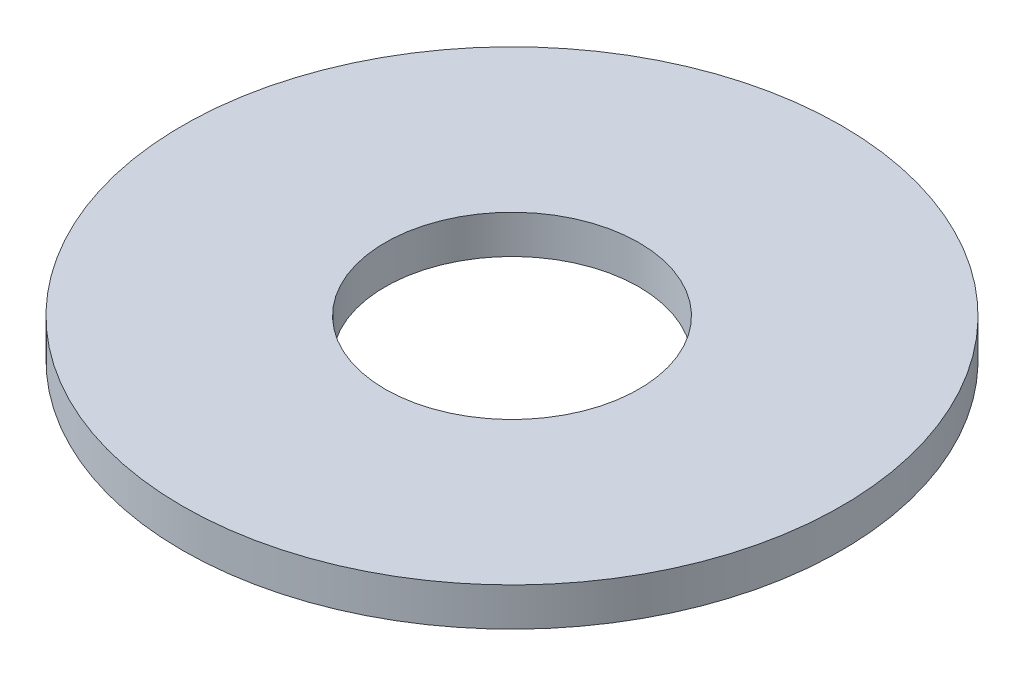
ISO-10303-21;
HEADER;
FILE_DESCRIPTION(('STEP AP214'),'2;1');
FILE_NAME('part.step','',(''),(''),'','','');
FILE_SCHEMA(('AUTOMOTIVE_DESIGN { 1 0 10303 214 1 1 1 1 }'));
ENDSEC;
DATA;
#1=APPLICATION_CONTEXT('core data for automotive mechanical design processes');
#2=APPLICATION_PROTOCOL_DEFINITION('international standard','automotive_design',2000,#1);
#3=PRODUCT_CONTEXT('',#1,'mechanical');
#4=PRODUCT('Part','Part','',(#3));
#5=PRODUCT_RELATED_PRODUCT_CATEGORY('part','',(#4));
#6=PRODUCT_DEFINITION_FORMATION('','',#4);
#7=PRODUCT_DEFINITION_CONTEXT('part definition',#1,'design');
#8=PRODUCT_DEFINITION('design','',#6,#7);
#9=PRODUCT_DEFINITION_SHAPE('','',#8);
#10=(LENGTH_UNIT() NAMED_UNIT(*) SI_UNIT(.MILLI.,.METRE.));
#11=(NAMED_UNIT(*) PLANE_ANGLE_UNIT() SI_UNIT($,.RADIAN.));
#12=(NAMED_UNIT(*) SI_UNIT($,.STERADIAN.) SOLID_ANGLE_UNIT());
#13=UNCERTAINTY_MEASURE_WITH_UNIT(LENGTH_MEASURE(1.E-05),#10,'distance_accuracy_value','');
#14=(GEOMETRIC_REPRESENTATION_CONTEXT(3) GLOBAL_UNCERTAINTY_ASSIGNED_CONTEXT((#13)) GLOBAL_UNIT_ASSIGNED_CONTEXT((#10,
#11,#12)) REPRESENTATION_CONTEXT('',''));
#15=CARTESIAN_POINT('',(0.,0.,0.));
#16=DIRECTION('',(0.,0.,1.));
#17=DIRECTION('',(1.,0.,0.));
#18=AXIS2_PLACEMENT_3D('',#15,#16,#17);
#19=CARTESIAN_POINT('',(0.,1.016,0.));
#20=DIRECTION('',(0.,1.,0.));
#21=DIRECTION('',(0.,0.,1.));
#22=AXIS2_PLACEMENT_3D('',#19,#20,#21);
#23=PLANE('',#22);
#24=CARTESIAN_POINT('',(0.,1.016,0.));
#25=DIRECTION('',(0.,1.,0.));
#26=DIRECTION('',(0.,0.,1.));
#27=AXIS2_PLACEMENT_3D('',#24,#25,#26);
#28=CIRCLE('',#27,8.7376);
#29=CARTESIAN_POINT('',(0.,1.016,8.7376));
#30=VERTEX_POINT('',#29);
#31=EDGE_CURVE('E10',#30,#30,#28,.T.);
#32=ORIENTED_EDGE('',*,*,#31,.T.);
#33=EDGE_LOOP('',(#32));
#34=FACE_BOUND('',#33,.T.);
#35=CARTESIAN_POINT('',(0.,1.016,0.));
#36=DIRECTION('',(0.,1.,0.));
#37=DIRECTION('',(0.,0.,1.));
#38=AXIS2_PLACEMENT_3D('',#35,#36,#37);
#39=CIRCLE('',#38,3.3655);
#40=CARTESIAN_POINT('',(0.,1.016,3.3655));
#41=VERTEX_POINT('',#40);
#42=EDGE_CURVE('E42',#41,#41,#39,.T.);
#43=ORIENTED_EDGE('',*,*,#42,.F.);
#44=EDGE_LOOP('',(#43));
#45=FACE_BOUND('',#44,.T.);
#46=ADVANCED_FACE('F31',(#34,#45),#23,.T.);
#47=CARTESIAN_POINT('',(0.,0.,0.));
#48=DIRECTION('',(0.,1.,0.));
#49=DIRECTION('',(0.,0.,1.));
#50=AXIS2_PLACEMENT_3D('',#47,#48,#49);
#51=PLANE('',#50);
#52=CARTESIAN_POINT('',(0.,0.,0.));
#53=DIRECTION('',(0.,1.,0.));
#54=DIRECTION('',(0.,0.,1.));
#55=AXIS2_PLACEMENT_3D('',#52,#53,#54);
#56=CIRCLE('',#55,8.7376);
#57=CARTESIAN_POINT('',(0.,0.,8.7376));
#58=VERTEX_POINT('',#57);
#59=EDGE_CURVE('E35',#58,#58,#56,.T.);
#60=ORIENTED_EDGE('',*,*,#59,.F.);
#61=EDGE_LOOP('',(#60));
#62=FACE_BOUND('',#61,.T.);
#63=CARTESIAN_POINT('',(0.,0.,0.));
#64=DIRECTION('',(0.,1.,0.));
#65=DIRECTION('',(0.,0.,1.));
#66=AXIS2_PLACEMENT_3D('',#63,#64,#65);
#67=CIRCLE('',#66,3.3655);
#68=CARTESIAN_POINT('',(0.,0.,3.3655));
#69=VERTEX_POINT('',#68);
#70=EDGE_CURVE('E44',#69,#69,#67,.T.);
#71=ORIENTED_EDGE('',*,*,#70,.T.);
#72=EDGE_LOOP('',(#71));
#73=FACE_BOUND('',#72,.T.);
#74=ADVANCED_FACE('F54',(#62,#73),#51,.F.);
#75=CARTESIAN_POINT('',(0.,1.016,0.));
#76=DIRECTION('',(0.,-1.,0.));
#77=DIRECTION('',(0.,0.,-1.));
#78=AXIS2_PLACEMENT_3D('',#75,#76,#77);
#79=CYLINDRICAL_SURFACE('',#78,8.7376);
#80=ORIENTED_EDGE('',*,*,#31,.F.);
#81=EDGE_LOOP('',(#80));
#82=FACE_BOUND('',#81,.T.);
#83=ORIENTED_EDGE('',*,*,#59,.T.);
#84=EDGE_LOOP('',(#83));
#85=FACE_BOUND('',#84,.T.);
#86=ADVANCED_FACE('F33',(#82,#85),#79,.T.);
#87=CARTESIAN_POINT('',(0.,1.016,0.));
#88=DIRECTION('',(0.,-1.,0.));
#89=DIRECTION('',(0.,0.,-1.));
#90=AXIS2_PLACEMENT_3D('',#87,#88,#89);
#91=CYLINDRICAL_SURFACE('',#90,3.3655);
#92=ORIENTED_EDGE('',*,*,#42,.T.);
#93=EDGE_LOOP('',(#92));
#94=FACE_BOUND('',#93,.T.);
#95=ORIENTED_EDGE('',*,*,#70,.F.);
#96=EDGE_LOOP('',(#95));
#97=FACE_BOUND('',#96,.T.);
#98=ADVANCED_FACE('F50',(#94,#97),#91,.F.);
#99=CLOSED_SHELL('',(#46,#74,#86,#98));
#100=MANIFOLD_SOLID_BREP('B2',#99);
#101=ADVANCED_BREP_SHAPE_REPRESENTATION('',(#18,#100),#14);
#102=SHAPE_DEFINITION_REPRESENTATION(#9,#101);
ENDSEC;
END-ISO-10303-21;
